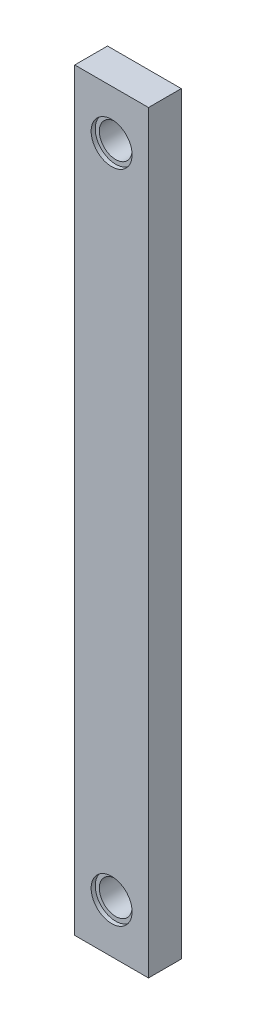
ISO-10303-21;
HEADER;
FILE_DESCRIPTION(('STEP AP214'),'2;1');
FILE_NAME('part.step','',(''),(''),'','','');
FILE_SCHEMA(('AUTOMOTIVE_DESIGN { 1 0 10303 214 1 1 1 1 }'));
ENDSEC;
DATA;
#1=APPLICATION_CONTEXT('core data for automotive mechanical design processes');
#2=APPLICATION_PROTOCOL_DEFINITION('international standard','automotive_design',2000,#1);
#3=PRODUCT_CONTEXT('',#1,'mechanical');
#4=PRODUCT('Part','Part','',(#3));
#5=PRODUCT_RELATED_PRODUCT_CATEGORY('part','',(#4));
#6=PRODUCT_DEFINITION_FORMATION('','',#4);
#7=PRODUCT_DEFINITION_CONTEXT('part definition',#1,'design');
#8=PRODUCT_DEFINITION('design','',#6,#7);
#9=PRODUCT_DEFINITION_SHAPE('','',#8);
#10=(LENGTH_UNIT() NAMED_UNIT(*) SI_UNIT(.MILLI.,.METRE.));
#11=(NAMED_UNIT(*) PLANE_ANGLE_UNIT() SI_UNIT($,.RADIAN.));
#12=(NAMED_UNIT(*) SI_UNIT($,.STERADIAN.) SOLID_ANGLE_UNIT());
#13=UNCERTAINTY_MEASURE_WITH_UNIT(LENGTH_MEASURE(1.E-05),#10,'distance_accuracy_value','');
#14=(GEOMETRIC_REPRESENTATION_CONTEXT(3) GLOBAL_UNCERTAINTY_ASSIGNED_CONTEXT((#13)) GLOBAL_UNIT_ASSIGNED_CONTEXT((#10,
#11,#12)) REPRESENTATION_CONTEXT('',''));
#15=CARTESIAN_POINT('',(0.,0.,0.));
#16=DIRECTION('',(0.,0.,1.));
#17=DIRECTION('',(1.,0.,0.));
#18=AXIS2_PLACEMENT_3D('',#15,#16,#17);
#19=CARTESIAN_POINT('',(0.,254.,-6.35));
#20=DIRECTION('',(0.,0.,1.));
#21=DIRECTION('',(1.,0.,0.));
#22=AXIS2_PLACEMENT_3D('',#19,#20,#21);
#23=CYLINDRICAL_SURFACE('',#22,6.35);
#24=CARTESIAN_POINT('',(0.,254.,-6.35));
#25=DIRECTION('',(0.,0.,-1.));
#26=DIRECTION('',(1.,0.,0.));
#27=AXIS2_PLACEMENT_3D('',#24,#25,#26);
#28=CIRCLE('',#27,6.35);
#29=CARTESIAN_POINT('',(6.34999999999998,254.,-6.35));
#30=VERTEX_POINT('',#29);
#31=EDGE_CURVE('E144',#30,#30,#28,.T.);
#32=ORIENTED_EDGE('',*,*,#31,.T.);
#33=EDGE_LOOP('',(#32));
#34=FACE_BOUND('',#33,.T.);
#35=CARTESIAN_POINT('',(0.,254.,4.7625));
#36=DIRECTION('',(0.,0.,1.));
#37=DIRECTION('',(1.,0.,0.));
#38=AXIS2_PLACEMENT_3D('',#35,#36,#37);
#39=CIRCLE('',#38,6.35);
#40=CARTESIAN_POINT('',(6.34999999999998,254.,4.7625));
#41=VERTEX_POINT('',#40);
#42=EDGE_CURVE('E45',#41,#41,#39,.T.);
#43=ORIENTED_EDGE('',*,*,#42,.T.);
#44=EDGE_LOOP('',(#43));
#45=FACE_BOUND('',#44,.T.);
#46=ADVANCED_FACE('F41',(#34,#45),#23,.F.);
#47=CARTESIAN_POINT('',(0.,0.,-6.35));
#48=DIRECTION('',(0.,0.,1.));
#49=DIRECTION('',(1.,0.,0.));
#50=AXIS2_PLACEMENT_3D('',#47,#48,#49);
#51=CYLINDRICAL_SURFACE('',#50,6.35);
#52=CARTESIAN_POINT('',(0.,0.,-6.35));
#53=DIRECTION('',(0.,0.,1.));
#54=DIRECTION('',(1.,0.,0.));
#55=AXIS2_PLACEMENT_3D('',#52,#53,#54);
#56=CIRCLE('',#55,6.35);
#57=CARTESIAN_POINT('',(6.35,0.,-6.35));
#58=VERTEX_POINT('',#57);
#59=EDGE_CURVE('E117',#58,#58,#56,.T.);
#60=ORIENTED_EDGE('',*,*,#59,.F.);
#61=EDGE_LOOP('',(#60));
#62=FACE_BOUND('',#61,.T.);
#63=CARTESIAN_POINT('',(0.,0.,4.7625));
#64=DIRECTION('',(0.,0.,1.));
#65=DIRECTION('',(1.,0.,0.));
#66=AXIS2_PLACEMENT_3D('',#63,#64,#65);
#67=CIRCLE('',#66,6.35);
#68=CARTESIAN_POINT('',(6.35,0.,4.7625));
#69=VERTEX_POINT('',#68);
#70=EDGE_CURVE('E127',#69,#69,#67,.F.);
#71=ORIENTED_EDGE('',*,*,#70,.F.);
#72=EDGE_LOOP('',(#71));
#73=FACE_BOUND('',#72,.T.);
#74=ADVANCED_FACE('F176',(#62,#73),#51,.F.);
#75=CARTESIAN_POINT('',(-14.2875,273.05,6.35));
#76=DIRECTION('',(1.,0.,0.));
#77=DIRECTION('',(0.,1.,0.));
#78=AXIS2_PLACEMENT_3D('',#75,#76,#77);
#79=PLANE('',#78);
#80=DIRECTION('',(0.,-1.,0.));
#81=VECTOR('',#80,1.);
#82=CARTESIAN_POINT('',(-14.2875,273.05,-6.35));
#83=LINE('',#82,#81);
#84=CARTESIAN_POINT('',(-14.2875,273.05,-6.35));
#85=VERTEX_POINT('',#84);
#86=CARTESIAN_POINT('',(-14.2875,-19.05,-6.35));
#87=VERTEX_POINT('',#86);
#88=EDGE_CURVE('E113',#85,#87,#83,.T.);
#89=ORIENTED_EDGE('',*,*,#88,.T.);
#90=DIRECTION('',(0.,0.,-1.));
#91=VECTOR('',#90,1.);
#92=CARTESIAN_POINT('',(-14.2875,-19.05,6.35));
#93=LINE('',#92,#91);
#94=CARTESIAN_POINT('',(-14.2875,-19.05,6.35));
#95=VERTEX_POINT('',#94);
#96=EDGE_CURVE('E11',#95,#87,#93,.T.);
#97=ORIENTED_EDGE('',*,*,#96,.F.);
#98=DIRECTION('',(0.,-1.,0.));
#99=VECTOR('',#98,1.);
#100=CARTESIAN_POINT('',(-14.2875,273.05,6.35));
#101=LINE('',#100,#99);
#102=CARTESIAN_POINT('',(-14.2875,273.05,6.35));
#103=VERTEX_POINT('',#102);
#104=EDGE_CURVE('E96',#103,#95,#101,.T.);
#105=ORIENTED_EDGE('',*,*,#104,.F.);
#106=DIRECTION('',(0.,0.,-1.));
#107=VECTOR('',#106,1.);
#108=CARTESIAN_POINT('',(-14.2875,273.05,6.35));
#109=LINE('',#108,#107);
#110=EDGE_CURVE('E109',#103,#85,#109,.T.);
#111=ORIENTED_EDGE('',*,*,#110,.T.);
#112=EDGE_LOOP('',(#89,#97,#105,#111));
#113=FACE_BOUND('',#112,.T.);
#114=ADVANCED_FACE('F43',(#113),#79,.F.);
#115=CARTESIAN_POINT('',(-14.2875,-19.05,6.35));
#116=DIRECTION('',(0.,1.,0.));
#117=DIRECTION('',(-1.,0.,0.));
#118=AXIS2_PLACEMENT_3D('',#115,#116,#117);
#119=PLANE('',#118);
#120=DIRECTION('',(1.,0.,0.));
#121=VECTOR('',#120,1.);
#122=CARTESIAN_POINT('',(-14.2875,-19.05,-6.35));
#123=LINE('',#122,#121);
#124=CARTESIAN_POINT('',(14.2875,-19.05,-6.35));
#125=VERTEX_POINT('',#124);
#126=EDGE_CURVE('E101',#87,#125,#123,.T.);
#127=ORIENTED_EDGE('',*,*,#126,.T.);
#128=DIRECTION('',(0.,0.,-1.));
#129=VECTOR('',#128,1.);
#130=CARTESIAN_POINT('',(14.2875,-19.05,6.35));
#131=LINE('',#130,#129);
#132=CARTESIAN_POINT('',(14.2875,-19.05,6.35));
#133=VERTEX_POINT('',#132);
#134=EDGE_CURVE('E52',#133,#125,#131,.T.);
#135=ORIENTED_EDGE('',*,*,#134,.F.);
#136=DIRECTION('',(1.,0.,0.));
#137=VECTOR('',#136,1.);
#138=CARTESIAN_POINT('',(-14.2875,-19.05,6.35));
#139=LINE('',#138,#137);
#140=EDGE_CURVE('E91',#95,#133,#139,.T.);
#141=ORIENTED_EDGE('',*,*,#140,.F.);
#142=ORIENTED_EDGE('',*,*,#96,.T.);
#143=EDGE_LOOP('',(#127,#135,#141,#142));
#144=FACE_BOUND('',#143,.T.);
#145=ADVANCED_FACE('F100',(#144),#119,.F.);
#146=CARTESIAN_POINT('',(14.2875,273.05,6.35));
#147=DIRECTION('',(-1.,0.,0.));
#148=DIRECTION('',(0.,-1.,0.));
#149=AXIS2_PLACEMENT_3D('',#146,#147,#148);
#150=PLANE('',#149);
#151=DIRECTION('',(0.,1.,0.));
#152=VECTOR('',#151,1.);
#153=CARTESIAN_POINT('',(14.2875,273.05,-6.35));
#154=LINE('',#153,#152);
#155=CARTESIAN_POINT('',(14.2875,273.05,-6.35));
#156=VERTEX_POINT('',#155);
#157=EDGE_CURVE('E78',#125,#156,#154,.T.);
#158=ORIENTED_EDGE('',*,*,#157,.T.);
#159=DIRECTION('',(0.,0.,-1.));
#160=VECTOR('',#159,1.);
#161=CARTESIAN_POINT('',(14.2875,273.05,6.35));
#162=LINE('',#161,#160);
#163=CARTESIAN_POINT('',(14.2875,273.05,6.35));
#164=VERTEX_POINT('',#163);
#165=EDGE_CURVE('E103',#164,#156,#162,.T.);
#166=ORIENTED_EDGE('',*,*,#165,.F.);
#167=DIRECTION('',(0.,1.,0.));
#168=VECTOR('',#167,1.);
#169=CARTESIAN_POINT('',(14.2875,273.05,6.35));
#170=LINE('',#169,#168);
#171=EDGE_CURVE('E94',#133,#164,#170,.T.);
#172=ORIENTED_EDGE('',*,*,#171,.F.);
#173=ORIENTED_EDGE('',*,*,#134,.T.);
#174=EDGE_LOOP('',(#158,#166,#172,#173));
#175=FACE_BOUND('',#174,.T.);
#176=ADVANCED_FACE('F105',(#175),#150,.F.);
#177=CARTESIAN_POINT('',(-14.2875,273.05,6.35));
#178=DIRECTION('',(0.,-1.,0.));
#179=DIRECTION('',(0.,0.,-1.));
#180=AXIS2_PLACEMENT_3D('',#177,#178,#179);
#181=PLANE('',#180);
#182=DIRECTION('',(-1.,0.,0.));
#183=VECTOR('',#182,1.);
#184=CARTESIAN_POINT('',(-14.2875,273.05,-6.35));
#185=LINE('',#184,#183);
#186=EDGE_CURVE('E84',#156,#85,#185,.T.);
#187=ORIENTED_EDGE('',*,*,#186,.T.);
#188=ORIENTED_EDGE('',*,*,#110,.F.);
#189=DIRECTION('',(-1.,0.,0.));
#190=VECTOR('',#189,1.);
#191=CARTESIAN_POINT('',(-14.2875,273.05,6.35));
#192=LINE('',#191,#190);
#193=EDGE_CURVE('E61',#164,#103,#192,.T.);
#194=ORIENTED_EDGE('',*,*,#193,.F.);
#195=ORIENTED_EDGE('',*,*,#165,.T.);
#196=EDGE_LOOP('',(#187,#188,#194,#195));
#197=FACE_BOUND('',#196,.T.);
#198=ADVANCED_FACE('F194',(#197),#181,.F.);
#199=CARTESIAN_POINT('',(0.,0.,6.35));
#200=DIRECTION('',(0.,0.,1.));
#201=DIRECTION('',(1.,0.,0.));
#202=AXIS2_PLACEMENT_3D('',#199,#200,#201);
#203=PLANE('',#202);
#204=CARTESIAN_POINT('',(0.,254.,6.35));
#205=DIRECTION('',(0.,0.,-1.));
#206=DIRECTION('',(1.,0.,0.));
#207=AXIS2_PLACEMENT_3D('',#204,#205,#206);
#208=CIRCLE('',#207,7.9375);
#209=CARTESIAN_POINT('',(7.93749999999998,254.,6.35));
#210=VERTEX_POINT('',#209);
#211=EDGE_CURVE('E151',#210,#210,#208,.T.);
#212=ORIENTED_EDGE('',*,*,#211,.T.);
#213=EDGE_LOOP('',(#212));
#214=FACE_BOUND('',#213,.T.);
#215=CARTESIAN_POINT('',(0.,0.,6.35));
#216=DIRECTION('',(0.,0.,1.));
#217=DIRECTION('',(1.,0.,0.));
#218=AXIS2_PLACEMENT_3D('',#215,#216,#217);
#219=CIRCLE('',#218,7.9375);
#220=CARTESIAN_POINT('',(7.9375,0.,6.35));
#221=VERTEX_POINT('',#220);
#222=EDGE_CURVE('E138',#221,#221,#219,.T.);
#223=ORIENTED_EDGE('',*,*,#222,.F.);
#224=EDGE_LOOP('',(#223));
#225=FACE_BOUND('',#224,.T.);
#226=ORIENTED_EDGE('',*,*,#104,.T.);
#227=ORIENTED_EDGE('',*,*,#140,.T.);
#228=ORIENTED_EDGE('',*,*,#171,.T.);
#229=ORIENTED_EDGE('',*,*,#193,.T.);
#230=EDGE_LOOP('',(#226,#227,#228,#229));
#231=FACE_BOUND('',#230,.T.);
#232=ADVANCED_FACE('F92',(#214,#225,#231),#203,.T.);
#233=CARTESIAN_POINT('',(0.,0.,-6.35));
#234=DIRECTION('',(0.,0.,1.));
#235=DIRECTION('',(1.,0.,0.));
#236=AXIS2_PLACEMENT_3D('',#233,#234,#235);
#237=PLANE('',#236);
#238=ORIENTED_EDGE('',*,*,#31,.F.);
#239=EDGE_LOOP('',(#238));
#240=FACE_BOUND('',#239,.T.);
#241=ORIENTED_EDGE('',*,*,#59,.T.);
#242=EDGE_LOOP('',(#241));
#243=FACE_BOUND('',#242,.T.);
#244=ORIENTED_EDGE('',*,*,#88,.F.);
#245=ORIENTED_EDGE('',*,*,#186,.F.);
#246=ORIENTED_EDGE('',*,*,#157,.F.);
#247=ORIENTED_EDGE('',*,*,#126,.F.);
#248=EDGE_LOOP('',(#244,#245,#246,#247));
#249=FACE_BOUND('',#248,.T.);
#250=ADVANCED_FACE('F188',(#240,#243,#249),#237,.F.);
#251=CARTESIAN_POINT('',(0.,0.,4.7625));
#252=DIRECTION('',(0.,0.,1.));
#253=DIRECTION('',(1.,0.,0.));
#254=AXIS2_PLACEMENT_3D('',#251,#252,#253);
#255=PLANE('',#254);
#256=CARTESIAN_POINT('',(0.,0.,4.7625));
#257=DIRECTION('',(0.,0.,1.));
#258=DIRECTION('',(1.,0.,0.));
#259=AXIS2_PLACEMENT_3D('',#256,#257,#258);
#260=CIRCLE('',#259,7.9375);
#261=CARTESIAN_POINT('',(7.9375,0.,4.7625));
#262=VERTEX_POINT('',#261);
#263=EDGE_CURVE('E130',#262,#262,#260,.T.);
#264=ORIENTED_EDGE('',*,*,#263,.T.);
#265=EDGE_LOOP('',(#264));
#266=FACE_BOUND('',#265,.T.);
#267=ORIENTED_EDGE('',*,*,#70,.T.);
#268=EDGE_LOOP('',(#267));
#269=FACE_BOUND('',#268,.T.);
#270=ADVANCED_FACE('F185',(#266,#269),#255,.T.);
#271=CARTESIAN_POINT('',(0.,0.,4.7625));
#272=DIRECTION('',(0.,0.,1.));
#273=DIRECTION('',(1.,0.,0.));
#274=AXIS2_PLACEMENT_3D('',#271,#272,#273);
#275=CYLINDRICAL_SURFACE('',#274,7.9375);
#276=ORIENTED_EDGE('',*,*,#263,.F.);
#277=EDGE_LOOP('',(#276));
#278=FACE_BOUND('',#277,.T.);
#279=ORIENTED_EDGE('',*,*,#222,.T.);
#280=EDGE_LOOP('',(#279));
#281=FACE_BOUND('',#280,.T.);
#282=ADVANCED_FACE('F173',(#278,#281),#275,.F.);
#283=CARTESIAN_POINT('',(0.,254.,4.7625));
#284=DIRECTION('',(0.,0.,1.));
#285=DIRECTION('',(1.,0.,0.));
#286=AXIS2_PLACEMENT_3D('',#283,#284,#285);
#287=CYLINDRICAL_SURFACE('',#286,7.9375);
#288=CARTESIAN_POINT('',(0.,254.,4.7625));
#289=DIRECTION('',(0.,0.,-1.));
#290=DIRECTION('',(1.,0.,0.));
#291=AXIS2_PLACEMENT_3D('',#288,#289,#290);
#292=CIRCLE('',#291,7.9375);
#293=CARTESIAN_POINT('',(7.93749999999998,254.,4.7625));
#294=VERTEX_POINT('',#293);
#295=EDGE_CURVE('E155',#294,#294,#292,.T.);
#296=ORIENTED_EDGE('',*,*,#295,.T.);
#297=EDGE_LOOP('',(#296));
#298=FACE_BOUND('',#297,.T.);
#299=ORIENTED_EDGE('',*,*,#211,.F.);
#300=EDGE_LOOP('',(#299));
#301=FACE_BOUND('',#300,.T.);
#302=ADVANCED_FACE('F168',(#298,#301),#287,.F.);
#303=CARTESIAN_POINT('',(0.,254.,4.7625));
#304=DIRECTION('',(0.,0.,1.));
#305=DIRECTION('',(1.,0.,0.));
#306=AXIS2_PLACEMENT_3D('',#303,#304,#305);
#307=PLANE('',#306);
#308=ORIENTED_EDGE('',*,*,#42,.F.);
#309=EDGE_LOOP('',(#308));
#310=FACE_BOUND('',#309,.T.);
#311=ORIENTED_EDGE('',*,*,#295,.F.);
#312=EDGE_LOOP('',(#311));
#313=FACE_BOUND('',#312,.T.);
#314=ADVANCED_FACE('F165',(#310,#313),#307,.T.);
#315=CLOSED_SHELL('',(#46,#74,#114,#145,#176,#198,#232,#250,#270,#282,#302,#314));
#316=MANIFOLD_SOLID_BREP('B2',#315);
#317=ADVANCED_BREP_SHAPE_REPRESENTATION('',(#18,#316),#14);
#318=SHAPE_DEFINITION_REPRESENTATION(#9,#317);
ENDSEC;
END-ISO-10303-21;
